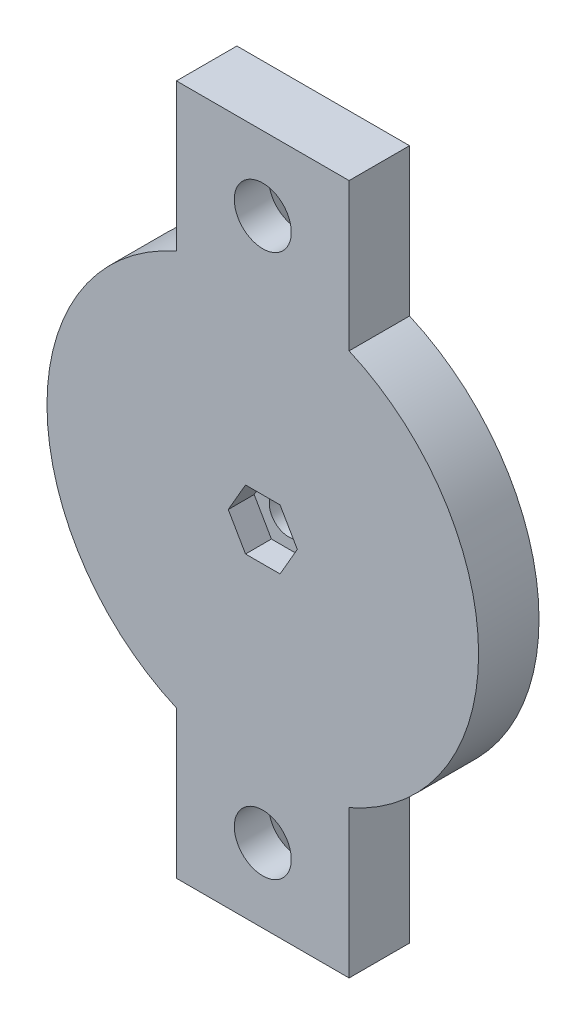
ISO-10303-21;
HEADER;
FILE_DESCRIPTION(('STEP AP214'),'2;1');
FILE_NAME('part.step','',(''),(''),'','','');
FILE_SCHEMA(('AUTOMOTIVE_DESIGN { 1 0 10303 214 1 1 1 1 }'));
ENDSEC;
DATA;
#1=APPLICATION_CONTEXT('core data for automotive mechanical design processes');
#2=APPLICATION_PROTOCOL_DEFINITION('international standard','automotive_design',2000,#1);
#3=PRODUCT_CONTEXT('',#1,'mechanical');
#4=PRODUCT('Part','Part','',(#3));
#5=PRODUCT_RELATED_PRODUCT_CATEGORY('part','',(#4));
#6=PRODUCT_DEFINITION_FORMATION('','',#4);
#7=PRODUCT_DEFINITION_CONTEXT('part definition',#1,'design');
#8=PRODUCT_DEFINITION('design','',#6,#7);
#9=PRODUCT_DEFINITION_SHAPE('','',#8);
#10=(LENGTH_UNIT() NAMED_UNIT(*) SI_UNIT(.MILLI.,.METRE.));
#11=(NAMED_UNIT(*) PLANE_ANGLE_UNIT() SI_UNIT($,.RADIAN.));
#12=(NAMED_UNIT(*) SI_UNIT($,.STERADIAN.) SOLID_ANGLE_UNIT());
#13=UNCERTAINTY_MEASURE_WITH_UNIT(LENGTH_MEASURE(1.E-05),#10,'distance_accuracy_value','');
#14=(GEOMETRIC_REPRESENTATION_CONTEXT(3) GLOBAL_UNCERTAINTY_ASSIGNED_CONTEXT((#13)) GLOBAL_UNIT_ASSIGNED_CONTEXT((#10,
#11,#12)) REPRESENTATION_CONTEXT('',''));
#15=CARTESIAN_POINT('',(0.,0.,0.));
#16=DIRECTION('',(0.,0.,1.));
#17=DIRECTION('',(1.,0.,0.));
#18=AXIS2_PLACEMENT_3D('',#15,#16,#17);
#19=CARTESIAN_POINT('',(0.,0.,0.));
#20=DIRECTION('',(0.,0.,1.));
#21=DIRECTION('',(1.,0.,0.));
#22=AXIS2_PLACEMENT_3D('',#19,#20,#21);
#23=PLANE('',#22);
#24=CARTESIAN_POINT('',(1.87575649457372E-11,-31.4564392373915,0.));
#25=DIRECTION('',(0.,0.,-1.));
#26=DIRECTION('',(-1.,0.,0.));
#27=AXIS2_PLACEMENT_3D('',#24,#25,#26);
#28=CIRCLE('',#27,6.3);
#29=CARTESIAN_POINT('',(-6.29999999998124,-31.4564392373915,0.));
#30=VERTEX_POINT('',#29);
#31=EDGE_CURVE('E201',#30,#30,#28,.T.);
#32=ORIENTED_EDGE('',*,*,#31,.F.);
#33=EDGE_LOOP('',(#32));
#34=FACE_BOUND('',#33,.T.);
#35=CARTESIAN_POINT('',(0.,0.,0.));
#36=DIRECTION('',(0.,0.,1.));
#37=DIRECTION('',(1.,0.,0.));
#38=AXIS2_PLACEMENT_3D('',#35,#36,#37);
#39=CIRCLE('',#38,25.);
#40=CARTESIAN_POINT('',(10.0000000000188,-22.9128784747596,0.));
#41=VERTEX_POINT('',#40);
#42=CARTESIAN_POINT('',(9.99999999998124,22.9128784747596,0.));
#43=VERTEX_POINT('',#42);
#44=EDGE_CURVE('E37',#41,#43,#39,.T.);
#45=ORIENTED_EDGE('',*,*,#44,.F.);
#46=DIRECTION('',(0.,1.,0.));
#47=VECTOR('',#46,1.);
#48=CARTESIAN_POINT('',(10.0000000000188,-22.9128784747596,0.));
#49=LINE('',#48,#47);
#50=CARTESIAN_POINT('',(10.0000000000188,-40.,0.));
#51=VERTEX_POINT('',#50);
#52=EDGE_CURVE('E184',#51,#41,#49,.T.);
#53=ORIENTED_EDGE('',*,*,#52,.F.);
#54=DIRECTION('',(1.,0.,0.));
#55=VECTOR('',#54,1.);
#56=CARTESIAN_POINT('',(-9.99999999998124,-40.,0.));
#57=LINE('',#56,#55);
#58=CARTESIAN_POINT('',(-9.99999999998124,-40.,0.));
#59=VERTEX_POINT('',#58);
#60=EDGE_CURVE('E178',#59,#51,#57,.T.);
#61=ORIENTED_EDGE('',*,*,#60,.F.);
#62=DIRECTION('',(0.,-1.,0.));
#63=VECTOR('',#62,1.);
#64=CARTESIAN_POINT('',(-9.99999999998124,-22.9128784747596,0.));
#65=LINE('',#64,#63);
#66=CARTESIAN_POINT('',(-9.99999999999142,-22.9128784747829,0.));
#67=VERTEX_POINT('',#66);
#68=EDGE_CURVE('E160',#67,#59,#65,.T.);
#69=ORIENTED_EDGE('',*,*,#68,.F.);
#70=CARTESIAN_POINT('',(-10.0000000000188,22.9128784747596,0.));
#71=VERTEX_POINT('',#70);
#72=EDGE_CURVE('E151',#71,#67,#39,.T.);
#73=ORIENTED_EDGE('',*,*,#72,.F.);
#74=DIRECTION('',(0.,-1.,0.));
#75=VECTOR('',#74,1.);
#76=CARTESIAN_POINT('',(-10.0000000000188,22.9128784747596,0.));
#77=LINE('',#76,#75);
#78=CARTESIAN_POINT('',(-10.0000000000188,40.,0.));
#79=VERTEX_POINT('',#78);
#80=EDGE_CURVE('E135',#79,#71,#77,.T.);
#81=ORIENTED_EDGE('',*,*,#80,.F.);
#82=DIRECTION('',(-1.,0.,0.));
#83=VECTOR('',#82,1.);
#84=CARTESIAN_POINT('',(9.99999999998124,40.,0.));
#85=LINE('',#84,#83);
#86=CARTESIAN_POINT('',(9.99999999998124,40.,0.));
#87=VERTEX_POINT('',#86);
#88=EDGE_CURVE('E154',#87,#79,#85,.T.);
#89=ORIENTED_EDGE('',*,*,#88,.F.);
#90=DIRECTION('',(0.,1.,0.));
#91=VECTOR('',#90,1.);
#92=CARTESIAN_POINT('',(9.99999999998124,22.9128784747596,0.));
#93=LINE('',#92,#91);
#94=EDGE_CURVE('E145',#43,#87,#93,.T.);
#95=ORIENTED_EDGE('',*,*,#94,.F.);
#96=EDGE_LOOP('',(#45,#53,#61,#69,#73,#81,#89,#95));
#97=FACE_BOUND('',#96,.T.);
#98=CARTESIAN_POINT('',(0.,0.,0.));
#99=DIRECTION('',(0.,0.,1.));
#100=DIRECTION('',(1.,0.,0.));
#101=AXIS2_PLACEMENT_3D('',#98,#99,#100);
#102=CIRCLE('',#101,2.24999999999999);
#103=CARTESIAN_POINT('',(2.24999999999999,0.,0.));
#104=VERTEX_POINT('',#103);
#105=EDGE_CURVE('E234',#104,#104,#102,.T.);
#106=ORIENTED_EDGE('',*,*,#105,.T.);
#107=EDGE_LOOP('',(#106));
#108=FACE_BOUND('',#107,.T.);
#109=CARTESIAN_POINT('',(-1.87575649457372E-11,31.4564392373915,0.));
#110=DIRECTION('',(0.,0.,-1.));
#111=DIRECTION('',(-1.,0.,0.));
#112=AXIS2_PLACEMENT_3D('',#109,#110,#111);
#113=CIRCLE('',#112,6.3);
#114=CARTESIAN_POINT('',(-6.30000000001876,31.4564392373915,0.));
#115=VERTEX_POINT('',#114);
#116=EDGE_CURVE('E275',#115,#115,#113,.T.);
#117=ORIENTED_EDGE('',*,*,#116,.F.);
#118=EDGE_LOOP('',(#117));
#119=FACE_BOUND('',#118,.T.);
#120=ADVANCED_FACE('F33',(#34,#97,#108,#119),#23,.F.);
#121=CARTESIAN_POINT('',(0.,0.,7.));
#122=DIRECTION('',(0.,0.,-1.));
#123=DIRECTION('',(-1.,0.,0.));
#124=AXIS2_PLACEMENT_3D('',#121,#122,#123);
#125=CYLINDRICAL_SURFACE('',#124,25.);
#126=CARTESIAN_POINT('',(0.,0.,7.));
#127=DIRECTION('',(0.,0.,1.));
#128=DIRECTION('',(1.,0.,0.));
#129=AXIS2_PLACEMENT_3D('',#126,#127,#128);
#130=CIRCLE('',#129,25.);
#131=CARTESIAN_POINT('',(-10.0000000000229,22.9128784747692,7.));
#132=VERTEX_POINT('',#131);
#133=CARTESIAN_POINT('',(-9.99999999999142,-22.9128784747829,7.));
#134=VERTEX_POINT('',#133);
#135=EDGE_CURVE('E42',#132,#134,#130,.T.);
#136=ORIENTED_EDGE('',*,*,#135,.F.);
#137=DIRECTION('',(0.,0.,1.));
#138=VECTOR('',#137,1.);
#139=CARTESIAN_POINT('',(-10.0000000000188,22.9128784747596,0.));
#140=LINE('',#139,#138);
#141=EDGE_CURVE('E138',#71,#132,#140,.T.);
#142=ORIENTED_EDGE('',*,*,#141,.F.);
#143=ORIENTED_EDGE('',*,*,#72,.T.);
#144=DIRECTION('',(0.,0.,1.));
#145=VECTOR('',#144,1.);
#146=CARTESIAN_POINT('',(-9.99999999998124,-22.9128784747596,0.));
#147=LINE('',#146,#145);
#148=EDGE_CURVE('E169',#67,#134,#147,.T.);
#149=ORIENTED_EDGE('',*,*,#148,.T.);
#150=EDGE_LOOP('',(#136,#142,#143,#149));
#151=FACE_BOUND('',#150,.T.);
#152=ADVANCED_FACE('F149',(#151),#125,.T.);
#153=ORIENTED_EDGE('',*,*,#44,.T.);
#154=DIRECTION('',(0.,0.,1.));
#155=VECTOR('',#154,1.);
#156=CARTESIAN_POINT('',(9.99999999998124,22.9128784747596,0.));
#157=LINE('',#156,#155);
#158=CARTESIAN_POINT('',(9.99999999998124,22.9128784747596,7.));
#159=VERTEX_POINT('',#158);
#160=EDGE_CURVE('E153',#43,#159,#157,.T.);
#161=ORIENTED_EDGE('',*,*,#160,.T.);
#162=CARTESIAN_POINT('',(10.0000000000229,-22.9128784747692,7.));
#163=VERTEX_POINT('',#162);
#164=EDGE_CURVE('E11',#163,#159,#130,.T.);
#165=ORIENTED_EDGE('',*,*,#164,.F.);
#166=DIRECTION('',(0.,0.,1.));
#167=VECTOR('',#166,1.);
#168=CARTESIAN_POINT('',(10.0000000000188,-22.9128784747596,0.));
#169=LINE('',#168,#167);
#170=EDGE_CURVE('E176',#41,#163,#169,.T.);
#171=ORIENTED_EDGE('',*,*,#170,.F.);
#172=EDGE_LOOP('',(#153,#161,#165,#171));
#173=FACE_BOUND('',#172,.T.);
#174=ADVANCED_FACE('F35',(#173),#125,.T.);
#175=CARTESIAN_POINT('',(0.,0.,7.));
#176=DIRECTION('',(0.,0.,1.));
#177=DIRECTION('',(1.,0.,0.));
#178=AXIS2_PLACEMENT_3D('',#175,#176,#177);
#179=PLANE('',#178);
#180=CARTESIAN_POINT('',(-1.87575649457372E-11,31.4564392373915,7.));
#181=DIRECTION('',(0.,0.,-1.));
#182=DIRECTION('',(-1.,0.,0.));
#183=AXIS2_PLACEMENT_3D('',#180,#181,#182);
#184=CIRCLE('',#183,3.3);
#185=CARTESIAN_POINT('',(-3.30000000001876,31.4564392373915,7.));
#186=VERTEX_POINT('',#185);
#187=EDGE_CURVE('E266',#186,#186,#184,.T.);
#188=ORIENTED_EDGE('',*,*,#187,.T.);
#189=EDGE_LOOP('',(#188));
#190=FACE_BOUND('',#189,.T.);
#191=DIRECTION('',(0.5,0.866025403784439,0.));
#192=VECTOR('',#191,1.);
#193=CARTESIAN_POINT('',(2.,-3.46410161513775,7.));
#194=LINE('',#193,#192);
#195=CARTESIAN_POINT('',(2.,-3.46410161513775,7.));
#196=VERTEX_POINT('',#195);
#197=CARTESIAN_POINT('',(4.,0.,7.));
#198=VERTEX_POINT('',#197);
#199=EDGE_CURVE('E57',#196,#198,#194,.T.);
#200=ORIENTED_EDGE('',*,*,#199,.F.);
#201=DIRECTION('',(1.,0.,0.));
#202=VECTOR('',#201,1.);
#203=CARTESIAN_POINT('',(-2.,-3.46410161513775,7.));
#204=LINE('',#203,#202);
#205=CARTESIAN_POINT('',(-2.,-3.46410161513775,7.));
#206=VERTEX_POINT('',#205);
#207=EDGE_CURVE('E217',#206,#196,#204,.T.);
#208=ORIENTED_EDGE('',*,*,#207,.F.);
#209=DIRECTION('',(0.5,-0.866025403784439,0.));
#210=VECTOR('',#209,1.);
#211=CARTESIAN_POINT('',(-4.,0.,7.));
#212=LINE('',#211,#210);
#213=CARTESIAN_POINT('',(-4.,0.,7.));
#214=VERTEX_POINT('',#213);
#215=EDGE_CURVE('E221',#214,#206,#212,.T.);
#216=ORIENTED_EDGE('',*,*,#215,.F.);
#217=DIRECTION('',(-0.5,-0.866025403784439,0.));
#218=VECTOR('',#217,1.);
#219=CARTESIAN_POINT('',(-2.,3.46410161513775,7.));
#220=LINE('',#219,#218);
#221=CARTESIAN_POINT('',(-2.,3.46410161513775,7.));
#222=VERTEX_POINT('',#221);
#223=EDGE_CURVE('E224',#222,#214,#220,.T.);
#224=ORIENTED_EDGE('',*,*,#223,.F.);
#225=DIRECTION('',(-1.,0.,0.));
#226=VECTOR('',#225,1.);
#227=CARTESIAN_POINT('',(2.,3.46410161513775,7.));
#228=LINE('',#227,#226);
#229=CARTESIAN_POINT('',(2.,3.46410161513775,7.));
#230=VERTEX_POINT('',#229);
#231=EDGE_CURVE('E227',#230,#222,#228,.T.);
#232=ORIENTED_EDGE('',*,*,#231,.F.);
#233=DIRECTION('',(-0.5,0.866025403784439,0.));
#234=VECTOR('',#233,1.);
#235=CARTESIAN_POINT('',(4.,0.,7.));
#236=LINE('',#235,#234);
#237=EDGE_CURVE('E230',#198,#230,#236,.T.);
#238=ORIENTED_EDGE('',*,*,#237,.F.);
#239=EDGE_LOOP('',(#200,#208,#216,#224,#232,#238));
#240=FACE_BOUND('',#239,.T.);
#241=CARTESIAN_POINT('',(1.87575649457372E-11,-31.4564392373915,7.));
#242=DIRECTION('',(0.,0.,-1.));
#243=DIRECTION('',(-1.,0.,0.));
#244=AXIS2_PLACEMENT_3D('',#241,#242,#243);
#245=CIRCLE('',#244,3.3);
#246=CARTESIAN_POINT('',(-3.29999999998124,-31.4564392373915,7.));
#247=VERTEX_POINT('',#246);
#248=EDGE_CURVE('E190',#247,#247,#245,.T.);
#249=ORIENTED_EDGE('',*,*,#248,.T.);
#250=EDGE_LOOP('',(#249));
#251=FACE_BOUND('',#250,.T.);
#252=ORIENTED_EDGE('',*,*,#164,.T.);
#253=DIRECTION('',(0.,1.,0.));
#254=VECTOR('',#253,1.);
#255=CARTESIAN_POINT('',(9.99999999998124,22.9128784747596,7.));
#256=LINE('',#255,#254);
#257=CARTESIAN_POINT('',(9.99999999998124,40.,7.));
#258=VERTEX_POINT('',#257);
#259=EDGE_CURVE('E262',#159,#258,#256,.T.);
#260=ORIENTED_EDGE('',*,*,#259,.T.);
#261=DIRECTION('',(-1.,0.,0.));
#262=VECTOR('',#261,1.);
#263=CARTESIAN_POINT('',(9.99999999998124,40.,7.));
#264=LINE('',#263,#262);
#265=CARTESIAN_POINT('',(-10.0000000000188,40.,7.));
#266=VERTEX_POINT('',#265);
#267=EDGE_CURVE('E146',#258,#266,#264,.T.);
#268=ORIENTED_EDGE('',*,*,#267,.T.);
#269=DIRECTION('',(0.,-1.,0.));
#270=VECTOR('',#269,1.);
#271=CARTESIAN_POINT('',(-10.0000000000188,22.9128784747596,7.));
#272=LINE('',#271,#270);
#273=EDGE_CURVE('E49',#266,#132,#272,.T.);
#274=ORIENTED_EDGE('',*,*,#273,.T.);
#275=ORIENTED_EDGE('',*,*,#135,.T.);
#276=DIRECTION('',(0.,-1.,0.));
#277=VECTOR('',#276,1.);
#278=CARTESIAN_POINT('',(-9.99999999998124,-22.9128784747596,7.));
#279=LINE('',#278,#277);
#280=CARTESIAN_POINT('',(-9.99999999998124,-40.,7.));
#281=VERTEX_POINT('',#280);
#282=EDGE_CURVE('E189',#134,#281,#279,.T.);
#283=ORIENTED_EDGE('',*,*,#282,.T.);
#284=DIRECTION('',(1.,0.,0.));
#285=VECTOR('',#284,1.);
#286=CARTESIAN_POINT('',(-9.99999999998124,-40.,7.));
#287=LINE('',#286,#285);
#288=CARTESIAN_POINT('',(10.0000000000188,-40.,7.));
#289=VERTEX_POINT('',#288);
#290=EDGE_CURVE('E172',#281,#289,#287,.T.);
#291=ORIENTED_EDGE('',*,*,#290,.T.);
#292=DIRECTION('',(0.,1.,0.));
#293=VECTOR('',#292,1.);
#294=CARTESIAN_POINT('',(10.0000000000188,-22.9128784747596,7.));
#295=LINE('',#294,#293);
#296=EDGE_CURVE('E188',#289,#163,#295,.T.);
#297=ORIENTED_EDGE('',*,*,#296,.T.);
#298=EDGE_LOOP('',(#252,#260,#268,#274,#275,#283,#291,#297));
#299=FACE_BOUND('',#298,.T.);
#300=ADVANCED_FACE('F288',(#190,#240,#251,#299),#179,.T.);
#301=CARTESIAN_POINT('',(10.0000000000188,-22.9128784747596,0.));
#302=DIRECTION('',(1.,0.,0.));
#303=DIRECTION('',(0.,1.,0.));
#304=AXIS2_PLACEMENT_3D('',#301,#302,#303);
#305=PLANE('',#304);
#306=ORIENTED_EDGE('',*,*,#296,.F.);
#307=DIRECTION('',(0.,0.,1.));
#308=VECTOR('',#307,1.);
#309=CARTESIAN_POINT('',(10.0000000000188,-40.,0.));
#310=LINE('',#309,#308);
#311=EDGE_CURVE('E161',#51,#289,#310,.T.);
#312=ORIENTED_EDGE('',*,*,#311,.F.);
#313=ORIENTED_EDGE('',*,*,#52,.T.);
#314=ORIENTED_EDGE('',*,*,#170,.T.);
#315=EDGE_LOOP('',(#306,#312,#313,#314));
#316=FACE_BOUND('',#315,.T.);
#317=ADVANCED_FACE('F291',(#316),#305,.T.);
#318=CARTESIAN_POINT('',(-9.99999999998124,-40.,0.));
#319=DIRECTION('',(0.,-1.,0.));
#320=DIRECTION('',(0.,0.,-1.));
#321=AXIS2_PLACEMENT_3D('',#318,#319,#320);
#322=PLANE('',#321);
#323=ORIENTED_EDGE('',*,*,#290,.F.);
#324=DIRECTION('',(0.,0.,1.));
#325=VECTOR('',#324,1.);
#326=CARTESIAN_POINT('',(-9.99999999998124,-40.,0.));
#327=LINE('',#326,#325);
#328=EDGE_CURVE('E163',#59,#281,#327,.T.);
#329=ORIENTED_EDGE('',*,*,#328,.F.);
#330=ORIENTED_EDGE('',*,*,#60,.T.);
#331=ORIENTED_EDGE('',*,*,#311,.T.);
#332=EDGE_LOOP('',(#323,#329,#330,#331));
#333=FACE_BOUND('',#332,.T.);
#334=ADVANCED_FACE('F295',(#333),#322,.T.);
#335=CARTESIAN_POINT('',(-9.99999999998124,-22.9128784747596,0.));
#336=DIRECTION('',(-1.,0.,0.));
#337=DIRECTION('',(0.,-1.,0.));
#338=AXIS2_PLACEMENT_3D('',#335,#336,#337);
#339=PLANE('',#338);
#340=ORIENTED_EDGE('',*,*,#282,.F.);
#341=ORIENTED_EDGE('',*,*,#148,.F.);
#342=ORIENTED_EDGE('',*,*,#68,.T.);
#343=ORIENTED_EDGE('',*,*,#328,.T.);
#344=EDGE_LOOP('',(#340,#341,#342,#343));
#345=FACE_BOUND('',#344,.T.);
#346=ADVANCED_FACE('F296',(#345),#339,.T.);
#347=CARTESIAN_POINT('',(1.87575649457372E-11,-31.4564392373915,0.));
#348=DIRECTION('',(0.,0.,-1.));
#349=DIRECTION('',(-1.,0.,0.));
#350=AXIS2_PLACEMENT_3D('',#347,#348,#349);
#351=CYLINDRICAL_SURFACE('',#350,3.3);
#352=ORIENTED_EDGE('',*,*,#248,.F.);
#353=EDGE_LOOP('',(#352));
#354=FACE_BOUND('',#353,.T.);
#355=CARTESIAN_POINT('',(1.87575649457372E-11,-31.4564392373915,3.));
#356=DIRECTION('',(0.,0.,-1.));
#357=DIRECTION('',(-1.,0.,0.));
#358=AXIS2_PLACEMENT_3D('',#355,#356,#357);
#359=CIRCLE('',#358,3.3);
#360=CARTESIAN_POINT('',(-3.29999999998124,-31.4564392373915,3.));
#361=VERTEX_POINT('',#360);
#362=EDGE_CURVE('E198',#361,#361,#359,.T.);
#363=ORIENTED_EDGE('',*,*,#362,.T.);
#364=EDGE_LOOP('',(#363));
#365=FACE_BOUND('',#364,.T.);
#366=ADVANCED_FACE('F299',(#354,#365),#351,.F.);
#367=CARTESIAN_POINT('',(1.87575649457372E-11,-31.4564392373915,0.));
#368=DIRECTION('',(0.,0.,-1.));
#369=DIRECTION('',(-1.,0.,0.));
#370=AXIS2_PLACEMENT_3D('',#367,#368,#369);
#371=CONICAL_SURFACE('',#370,6.3,0.785398163397448);
#372=ORIENTED_EDGE('',*,*,#362,.F.);
#373=EDGE_LOOP('',(#372));
#374=FACE_BOUND('',#373,.T.);
#375=ORIENTED_EDGE('',*,*,#31,.T.);
#376=EDGE_LOOP('',(#375));
#377=FACE_BOUND('',#376,.T.);
#378=ADVANCED_FACE('F305',(#374,#377),#371,.F.);
#379=CARTESIAN_POINT('',(2.,-3.46410161513775,4.));
#380=DIRECTION('',(0.866025403784439,-0.5,0.));
#381=DIRECTION('',(0.5,0.866025403784439,0.));
#382=AXIS2_PLACEMENT_3D('',#379,#380,#381);
#383=PLANE('',#382);
#384=ORIENTED_EDGE('',*,*,#199,.T.);
#385=DIRECTION('',(0.,0.,1.));
#386=VECTOR('',#385,1.);
#387=CARTESIAN_POINT('',(4.,0.,4.));
#388=LINE('',#387,#386);
#389=CARTESIAN_POINT('',(4.,0.,4.));
#390=VERTEX_POINT('',#389);
#391=EDGE_CURVE('E205',#390,#198,#388,.T.);
#392=ORIENTED_EDGE('',*,*,#391,.F.);
#393=DIRECTION('',(0.5,0.866025403784439,0.));
#394=VECTOR('',#393,1.);
#395=CARTESIAN_POINT('',(2.,-3.46410161513775,4.));
#396=LINE('',#395,#394);
#397=CARTESIAN_POINT('',(2.,-3.46410161513775,4.));
#398=VERTEX_POINT('',#397);
#399=EDGE_CURVE('E220',#398,#390,#396,.T.);
#400=ORIENTED_EDGE('',*,*,#399,.F.);
#401=DIRECTION('',(0.,0.,1.));
#402=VECTOR('',#401,1.);
#403=CARTESIAN_POINT('',(2.,-3.46410161513775,4.));
#404=LINE('',#403,#402);
#405=EDGE_CURVE('E204',#398,#196,#404,.T.);
#406=ORIENTED_EDGE('',*,*,#405,.T.);
#407=EDGE_LOOP('',(#384,#392,#400,#406));
#408=FACE_BOUND('',#407,.T.);
#409=ADVANCED_FACE('F309',(#408),#383,.F.);
#410=CARTESIAN_POINT('',(-2.,-3.46410161513775,4.));
#411=DIRECTION('',(0.,-1.,0.));
#412=DIRECTION('',(0.,0.,-1.));
#413=AXIS2_PLACEMENT_3D('',#410,#411,#412);
#414=PLANE('',#413);
#415=ORIENTED_EDGE('',*,*,#207,.T.);
#416=ORIENTED_EDGE('',*,*,#405,.F.);
#417=DIRECTION('',(1.,0.,0.));
#418=VECTOR('',#417,1.);
#419=CARTESIAN_POINT('',(-2.,-3.46410161513775,4.));
#420=LINE('',#419,#418);
#421=CARTESIAN_POINT('',(-2.,-3.46410161513775,4.));
#422=VERTEX_POINT('',#421);
#423=EDGE_CURVE('E208',#422,#398,#420,.T.);
#424=ORIENTED_EDGE('',*,*,#423,.F.);
#425=DIRECTION('',(0.,0.,1.));
#426=VECTOR('',#425,1.);
#427=CARTESIAN_POINT('',(-2.,-3.46410161513775,4.));
#428=LINE('',#427,#426);
#429=EDGE_CURVE('E214',#422,#206,#428,.T.);
#430=ORIENTED_EDGE('',*,*,#429,.T.);
#431=EDGE_LOOP('',(#415,#416,#424,#430));
#432=FACE_BOUND('',#431,.T.);
#433=ADVANCED_FACE('F313',(#432),#414,.F.);
#434=CARTESIAN_POINT('',(-4.,0.,4.));
#435=DIRECTION('',(-0.866025403784438,-0.5,0.));
#436=DIRECTION('',(0.5,-0.866025403784439,0.));
#437=AXIS2_PLACEMENT_3D('',#434,#435,#436);
#438=PLANE('',#437);
#439=ORIENTED_EDGE('',*,*,#215,.T.);
#440=ORIENTED_EDGE('',*,*,#429,.F.);
#441=DIRECTION('',(0.5,-0.866025403784439,0.));
#442=VECTOR('',#441,1.);
#443=CARTESIAN_POINT('',(-4.,0.,4.));
#444=LINE('',#443,#442);
#445=CARTESIAN_POINT('',(-4.,0.,4.));
#446=VERTEX_POINT('',#445);
#447=EDGE_CURVE('E237',#446,#422,#444,.T.);
#448=ORIENTED_EDGE('',*,*,#447,.F.);
#449=DIRECTION('',(0.,0.,1.));
#450=VECTOR('',#449,1.);
#451=CARTESIAN_POINT('',(-4.,0.,4.));
#452=LINE('',#451,#450);
#453=EDGE_CURVE('E212',#446,#214,#452,.T.);
#454=ORIENTED_EDGE('',*,*,#453,.T.);
#455=EDGE_LOOP('',(#439,#440,#448,#454));
#456=FACE_BOUND('',#455,.T.);
#457=ADVANCED_FACE('F326',(#456),#438,.F.);
#458=CARTESIAN_POINT('',(-2.,3.46410161513775,4.));
#459=DIRECTION('',(-0.866025403784439,0.5,0.));
#460=DIRECTION('',(-0.5,-0.866025403784439,0.));
#461=AXIS2_PLACEMENT_3D('',#458,#459,#460);
#462=PLANE('',#461);
#463=ORIENTED_EDGE('',*,*,#223,.T.);
#464=ORIENTED_EDGE('',*,*,#453,.F.);
#465=DIRECTION('',(-0.5,-0.866025403784439,0.));
#466=VECTOR('',#465,1.);
#467=CARTESIAN_POINT('',(-2.,3.46410161513775,4.));
#468=LINE('',#467,#466);
#469=CARTESIAN_POINT('',(-2.,3.46410161513775,4.));
#470=VERTEX_POINT('',#469);
#471=EDGE_CURVE('E240',#470,#446,#468,.T.);
#472=ORIENTED_EDGE('',*,*,#471,.F.);
#473=DIRECTION('',(0.,0.,1.));
#474=VECTOR('',#473,1.);
#475=CARTESIAN_POINT('',(-2.,3.46410161513775,4.));
#476=LINE('',#475,#474);
#477=EDGE_CURVE('E210',#470,#222,#476,.T.);
#478=ORIENTED_EDGE('',*,*,#477,.T.);
#479=EDGE_LOOP('',(#463,#464,#472,#478));
#480=FACE_BOUND('',#479,.T.);
#481=ADVANCED_FACE('F322',(#480),#462,.F.);
#482=CARTESIAN_POINT('',(2.,3.46410161513775,4.));
#483=DIRECTION('',(0.,1.,0.));
#484=DIRECTION('',(-1.,0.,0.));
#485=AXIS2_PLACEMENT_3D('',#482,#483,#484);
#486=PLANE('',#485);
#487=ORIENTED_EDGE('',*,*,#231,.T.);
#488=ORIENTED_EDGE('',*,*,#477,.F.);
#489=DIRECTION('',(-1.,0.,0.));
#490=VECTOR('',#489,1.);
#491=CARTESIAN_POINT('',(2.,3.46410161513775,4.));
#492=LINE('',#491,#490);
#493=CARTESIAN_POINT('',(2.,3.46410161513775,4.));
#494=VERTEX_POINT('',#493);
#495=EDGE_CURVE('E243',#494,#470,#492,.T.);
#496=ORIENTED_EDGE('',*,*,#495,.F.);
#497=DIRECTION('',(0.,0.,1.));
#498=VECTOR('',#497,1.);
#499=CARTESIAN_POINT('',(2.,3.46410161513775,4.));
#500=LINE('',#499,#498);
#501=EDGE_CURVE('E207',#494,#230,#500,.T.);
#502=ORIENTED_EDGE('',*,*,#501,.T.);
#503=EDGE_LOOP('',(#487,#488,#496,#502));
#504=FACE_BOUND('',#503,.T.);
#505=ADVANCED_FACE('F318',(#504),#486,.F.);
#506=CARTESIAN_POINT('',(4.,0.,4.));
#507=DIRECTION('',(0.866025403784438,0.5,0.));
#508=DIRECTION('',(-0.5,0.866025403784439,0.));
#509=AXIS2_PLACEMENT_3D('',#506,#507,#508);
#510=PLANE('',#509);
#511=ORIENTED_EDGE('',*,*,#237,.T.);
#512=ORIENTED_EDGE('',*,*,#501,.F.);
#513=DIRECTION('',(-0.5,0.866025403784439,0.));
#514=VECTOR('',#513,1.);
#515=CARTESIAN_POINT('',(4.,0.,4.));
#516=LINE('',#515,#514);
#517=EDGE_CURVE('E246',#390,#494,#516,.T.);
#518=ORIENTED_EDGE('',*,*,#517,.F.);
#519=ORIENTED_EDGE('',*,*,#391,.T.);
#520=EDGE_LOOP('',(#511,#512,#518,#519));
#521=FACE_BOUND('',#520,.T.);
#522=ADVANCED_FACE('F314',(#521),#510,.F.);
#523=CARTESIAN_POINT('',(0.,0.,4.));
#524=DIRECTION('',(0.,0.,1.));
#525=DIRECTION('',(1.,0.,0.));
#526=AXIS2_PLACEMENT_3D('',#523,#524,#525);
#527=PLANE('',#526);
#528=CARTESIAN_POINT('',(0.,0.,4.));
#529=DIRECTION('',(0.,0.,1.));
#530=DIRECTION('',(1.,0.,0.));
#531=AXIS2_PLACEMENT_3D('',#528,#529,#530);
#532=CIRCLE('',#531,2.24999999999999);
#533=CARTESIAN_POINT('',(2.24999999999999,0.,4.));
#534=VERTEX_POINT('',#533);
#535=EDGE_CURVE('E253',#534,#534,#532,.T.);
#536=ORIENTED_EDGE('',*,*,#535,.F.);
#537=EDGE_LOOP('',(#536));
#538=FACE_BOUND('',#537,.T.);
#539=ORIENTED_EDGE('',*,*,#399,.T.);
#540=ORIENTED_EDGE('',*,*,#517,.T.);
#541=ORIENTED_EDGE('',*,*,#495,.T.);
#542=ORIENTED_EDGE('',*,*,#471,.T.);
#543=ORIENTED_EDGE('',*,*,#447,.T.);
#544=ORIENTED_EDGE('',*,*,#423,.T.);
#545=EDGE_LOOP('',(#539,#540,#541,#542,#543,#544));
#546=FACE_BOUND('',#545,.T.);
#547=ADVANCED_FACE('F317',(#538,#546),#527,.T.);
#548=CARTESIAN_POINT('',(0.,0.,4.));
#549=DIRECTION('',(0.,0.,1.));
#550=DIRECTION('',(1.,0.,0.));
#551=AXIS2_PLACEMENT_3D('',#548,#549,#550);
#552=CYLINDRICAL_SURFACE('',#551,2.24999999999999);
#553=ORIENTED_EDGE('',*,*,#535,.T.);
#554=EDGE_LOOP('',(#553));
#555=FACE_BOUND('',#554,.T.);
#556=ORIENTED_EDGE('',*,*,#105,.F.);
#557=EDGE_LOOP('',(#556));
#558=FACE_BOUND('',#557,.T.);
#559=ADVANCED_FACE('F336',(#555,#558),#552,.F.);
#560=CARTESIAN_POINT('',(-10.0000000000188,22.9128784747596,0.));
#561=DIRECTION('',(-1.,0.,0.));
#562=DIRECTION('',(0.,-1.,0.));
#563=AXIS2_PLACEMENT_3D('',#560,#561,#562);
#564=PLANE('',#563);
#565=ORIENTED_EDGE('',*,*,#273,.F.);
#566=DIRECTION('',(0.,0.,1.));
#567=VECTOR('',#566,1.);
#568=CARTESIAN_POINT('',(-10.0000000000188,40.,0.));
#569=LINE('',#568,#567);
#570=EDGE_CURVE('E140',#79,#266,#569,.T.);
#571=ORIENTED_EDGE('',*,*,#570,.F.);
#572=ORIENTED_EDGE('',*,*,#80,.T.);
#573=ORIENTED_EDGE('',*,*,#141,.T.);
#574=EDGE_LOOP('',(#565,#571,#572,#573));
#575=FACE_BOUND('',#574,.T.);
#576=ADVANCED_FACE('F137',(#575),#564,.T.);
#577=CARTESIAN_POINT('',(9.99999999998124,40.,0.));
#578=DIRECTION('',(0.,1.,0.));
#579=DIRECTION('',(0.,0.,1.));
#580=AXIS2_PLACEMENT_3D('',#577,#578,#579);
#581=PLANE('',#580);
#582=ORIENTED_EDGE('',*,*,#267,.F.);
#583=DIRECTION('',(0.,0.,1.));
#584=VECTOR('',#583,1.);
#585=CARTESIAN_POINT('',(9.99999999998124,40.,0.));
#586=LINE('',#585,#584);
#587=EDGE_CURVE('E258',#87,#258,#586,.T.);
#588=ORIENTED_EDGE('',*,*,#587,.F.);
#589=ORIENTED_EDGE('',*,*,#88,.T.);
#590=ORIENTED_EDGE('',*,*,#570,.T.);
#591=EDGE_LOOP('',(#582,#588,#589,#590));
#592=FACE_BOUND('',#591,.T.);
#593=ADVANCED_FACE('F343',(#592),#581,.T.);
#594=CARTESIAN_POINT('',(9.99999999998124,22.9128784747596,0.));
#595=DIRECTION('',(1.,0.,0.));
#596=DIRECTION('',(0.,1.,0.));
#597=AXIS2_PLACEMENT_3D('',#594,#595,#596);
#598=PLANE('',#597);
#599=ORIENTED_EDGE('',*,*,#259,.F.);
#600=ORIENTED_EDGE('',*,*,#160,.F.);
#601=ORIENTED_EDGE('',*,*,#94,.T.);
#602=ORIENTED_EDGE('',*,*,#587,.T.);
#603=EDGE_LOOP('',(#599,#600,#601,#602));
#604=FACE_BOUND('',#603,.T.);
#605=ADVANCED_FACE('F344',(#604),#598,.T.);
#606=CARTESIAN_POINT('',(-1.87575649457372E-11,31.4564392373915,0.));
#607=DIRECTION('',(0.,0.,-1.));
#608=DIRECTION('',(-1.,0.,0.));
#609=AXIS2_PLACEMENT_3D('',#606,#607,#608);
#610=CYLINDRICAL_SURFACE('',#609,3.3);
#611=ORIENTED_EDGE('',*,*,#187,.F.);
#612=EDGE_LOOP('',(#611));
#613=FACE_BOUND('',#612,.T.);
#614=CARTESIAN_POINT('',(-1.87575649457372E-11,31.4564392373915,3.));
#615=DIRECTION('',(0.,0.,-1.));
#616=DIRECTION('',(-1.,0.,0.));
#617=AXIS2_PLACEMENT_3D('',#614,#615,#616);
#618=CIRCLE('',#617,3.3);
#619=CARTESIAN_POINT('',(-3.30000000001876,31.4564392373915,3.));
#620=VERTEX_POINT('',#619);
#621=EDGE_CURVE('E272',#620,#620,#618,.T.);
#622=ORIENTED_EDGE('',*,*,#621,.T.);
#623=EDGE_LOOP('',(#622));
#624=FACE_BOUND('',#623,.T.);
#625=ADVANCED_FACE('F347',(#613,#624),#610,.F.);
#626=CARTESIAN_POINT('',(-1.87575649457372E-11,31.4564392373915,0.));
#627=DIRECTION('',(0.,0.,-1.));
#628=DIRECTION('',(-1.,0.,0.));
#629=AXIS2_PLACEMENT_3D('',#626,#627,#628);
#630=CONICAL_SURFACE('',#629,6.3,0.785398163397448);
#631=ORIENTED_EDGE('',*,*,#621,.F.);
#632=EDGE_LOOP('',(#631));
#633=FACE_BOUND('',#632,.T.);
#634=ORIENTED_EDGE('',*,*,#116,.T.);
#635=EDGE_LOOP('',(#634));
#636=FACE_BOUND('',#635,.T.);
#637=ADVANCED_FACE('F279',(#633,#636),#630,.F.);
#638=CLOSED_SHELL('',(#120,#152,#174,#300,#317,#334,#346,#366,#378,#409,#433,#457,#481,#505,
#522,#547,#559,#576,#593,#605,#625,#637));
#639=MANIFOLD_SOLID_BREP('B2',#638);
#640=ADVANCED_BREP_SHAPE_REPRESENTATION('',(#18,#639),#14);
#641=SHAPE_DEFINITION_REPRESENTATION(#9,#640);
ENDSEC;
END-ISO-10303-21;
